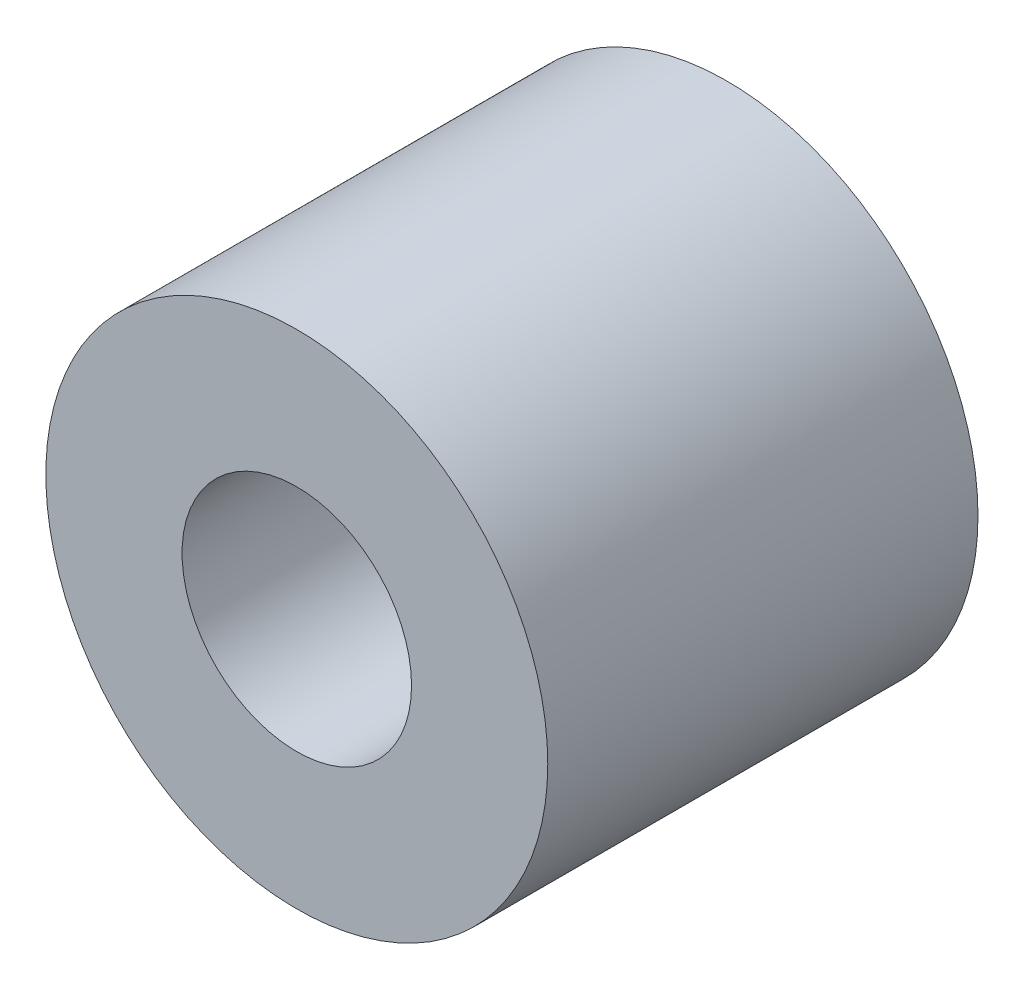
ISO-10303-21;
HEADER;
FILE_DESCRIPTION(('STEP AP214'),'2;1');
FILE_NAME('part.step','',(''),(''),'','','');
FILE_SCHEMA(('AUTOMOTIVE_DESIGN { 1 0 10303 214 1 1 1 1 }'));
ENDSEC;
DATA;
#1=APPLICATION_CONTEXT('core data for automotive mechanical design processes');
#2=APPLICATION_PROTOCOL_DEFINITION('international standard','automotive_design',2000,#1);
#3=PRODUCT_CONTEXT('',#1,'mechanical');
#4=PRODUCT('Part','Part','',(#3));
#5=PRODUCT_RELATED_PRODUCT_CATEGORY('part','',(#4));
#6=PRODUCT_DEFINITION_FORMATION('','',#4);
#7=PRODUCT_DEFINITION_CONTEXT('part definition',#1,'design');
#8=PRODUCT_DEFINITION('design','',#6,#7);
#9=PRODUCT_DEFINITION_SHAPE('','',#8);
#10=(LENGTH_UNIT() NAMED_UNIT(*) SI_UNIT(.MILLI.,.METRE.));
#11=(NAMED_UNIT(*) PLANE_ANGLE_UNIT() SI_UNIT($,.RADIAN.));
#12=(NAMED_UNIT(*) SI_UNIT($,.STERADIAN.) SOLID_ANGLE_UNIT());
#13=UNCERTAINTY_MEASURE_WITH_UNIT(LENGTH_MEASURE(1.E-05),#10,'distance_accuracy_value','');
#14=(GEOMETRIC_REPRESENTATION_CONTEXT(3) GLOBAL_UNCERTAINTY_ASSIGNED_CONTEXT((#13)) GLOBAL_UNIT_ASSIGNED_CONTEXT((#10,
#11,#12)) REPRESENTATION_CONTEXT('',''));
#15=CARTESIAN_POINT('',(0.,0.,0.));
#16=DIRECTION('',(0.,0.,1.));
#17=DIRECTION('',(1.,0.,0.));
#18=AXIS2_PLACEMENT_3D('',#15,#16,#17);
#19=CARTESIAN_POINT('',(0.,0.,6.));
#20=DIRECTION('',(0.,0.,1.));
#21=DIRECTION('',(1.,0.,0.));
#22=AXIS2_PLACEMENT_3D('',#19,#20,#21);
#23=PLANE('',#22);
#24=CARTESIAN_POINT('',(0.,0.,6.));
#25=DIRECTION('',(0.,0.,1.));
#26=DIRECTION('',(1.,0.,0.));
#27=AXIS2_PLACEMENT_3D('',#24,#25,#26);
#28=CIRCLE('',#27,3.5);
#29=CARTESIAN_POINT('',(3.5,0.,6.));
#30=VERTEX_POINT('',#29);
#31=EDGE_CURVE('E10',#30,#30,#28,.T.);
#32=ORIENTED_EDGE('',*,*,#31,.T.);
#33=EDGE_LOOP('',(#32));
#34=FACE_BOUND('',#33,.T.);
#35=CARTESIAN_POINT('',(0.,0.,6.));
#36=DIRECTION('',(0.,0.,1.));
#37=DIRECTION('',(1.,0.,0.));
#38=AXIS2_PLACEMENT_3D('',#35,#36,#37);
#39=CIRCLE('',#38,1.6);
#40=CARTESIAN_POINT('',(1.6,0.,6.));
#41=VERTEX_POINT('',#40);
#42=EDGE_CURVE('E43',#41,#41,#39,.T.);
#43=ORIENTED_EDGE('',*,*,#42,.F.);
#44=EDGE_LOOP('',(#43));
#45=FACE_BOUND('',#44,.T.);
#46=ADVANCED_FACE('F32',(#34,#45),#23,.T.);
#47=CARTESIAN_POINT('',(0.,0.,0.));
#48=DIRECTION('',(0.,0.,1.));
#49=DIRECTION('',(1.,0.,0.));
#50=AXIS2_PLACEMENT_3D('',#47,#48,#49);
#51=PLANE('',#50);
#52=CARTESIAN_POINT('',(0.,0.,0.));
#53=DIRECTION('',(0.,0.,1.));
#54=DIRECTION('',(1.,0.,0.));
#55=AXIS2_PLACEMENT_3D('',#52,#53,#54);
#56=CIRCLE('',#55,3.5);
#57=CARTESIAN_POINT('',(3.5,0.,0.));
#58=VERTEX_POINT('',#57);
#59=EDGE_CURVE('E36',#58,#58,#56,.T.);
#60=ORIENTED_EDGE('',*,*,#59,.F.);
#61=EDGE_LOOP('',(#60));
#62=FACE_BOUND('',#61,.T.);
#63=CARTESIAN_POINT('',(0.,0.,0.));
#64=DIRECTION('',(0.,0.,1.));
#65=DIRECTION('',(1.,0.,0.));
#66=AXIS2_PLACEMENT_3D('',#63,#64,#65);
#67=CIRCLE('',#66,1.6);
#68=CARTESIAN_POINT('',(1.6,0.,0.));
#69=VERTEX_POINT('',#68);
#70=EDGE_CURVE('E45',#69,#69,#67,.T.);
#71=ORIENTED_EDGE('',*,*,#70,.T.);
#72=EDGE_LOOP('',(#71));
#73=FACE_BOUND('',#72,.T.);
#74=ADVANCED_FACE('F55',(#62,#73),#51,.F.);
#75=CARTESIAN_POINT('',(0.,0.,6.));
#76=DIRECTION('',(0.,0.,-1.));
#77=DIRECTION('',(-1.,0.,0.));
#78=AXIS2_PLACEMENT_3D('',#75,#76,#77);
#79=CYLINDRICAL_SURFACE('',#78,3.5);
#80=ORIENTED_EDGE('',*,*,#31,.F.);
#81=EDGE_LOOP('',(#80));
#82=FACE_BOUND('',#81,.T.);
#83=ORIENTED_EDGE('',*,*,#59,.T.);
#84=EDGE_LOOP('',(#83));
#85=FACE_BOUND('',#84,.T.);
#86=ADVANCED_FACE('F34',(#82,#85),#79,.T.);
#87=CARTESIAN_POINT('',(0.,0.,6.));
#88=DIRECTION('',(0.,0.,-1.));
#89=DIRECTION('',(-1.,0.,0.));
#90=AXIS2_PLACEMENT_3D('',#87,#88,#89);
#91=CYLINDRICAL_SURFACE('',#90,1.6);
#92=ORIENTED_EDGE('',*,*,#42,.T.);
#93=EDGE_LOOP('',(#92));
#94=FACE_BOUND('',#93,.T.);
#95=ORIENTED_EDGE('',*,*,#70,.F.);
#96=EDGE_LOOP('',(#95));
#97=FACE_BOUND('',#96,.T.);
#98=ADVANCED_FACE('F51',(#94,#97),#91,.F.);
#99=CLOSED_SHELL('',(#46,#74,#86,#98));
#100=MANIFOLD_SOLID_BREP('B2',#99);
#101=ADVANCED_BREP_SHAPE_REPRESENTATION('',(#18,#100),#14);
#102=SHAPE_DEFINITION_REPRESENTATION(#9,#101);
ENDSEC;
END-ISO-10303-21;
